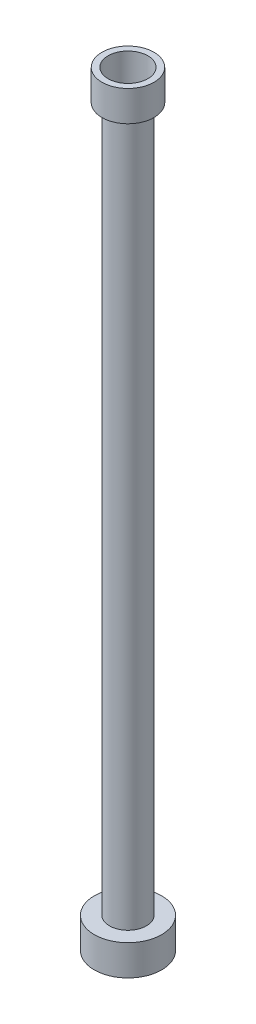
ISO-10303-21;
HEADER;
FILE_DESCRIPTION(('STEP AP214'),'2;1');
FILE_NAME('part.step','',(''),(''),'','','');
FILE_SCHEMA(('AUTOMOTIVE_DESIGN { 1 0 10303 214 1 1 1 1 }'));
ENDSEC;
DATA;
#1=APPLICATION_CONTEXT('core data for automotive mechanical design processes');
#2=APPLICATION_PROTOCOL_DEFINITION('international standard','automotive_design',2000,#1);
#3=PRODUCT_CONTEXT('',#1,'mechanical');
#4=PRODUCT('Part','Part','',(#3));
#5=PRODUCT_RELATED_PRODUCT_CATEGORY('part','',(#4));
#6=PRODUCT_DEFINITION_FORMATION('','',#4);
#7=PRODUCT_DEFINITION_CONTEXT('part definition',#1,'design');
#8=PRODUCT_DEFINITION('design','',#6,#7);
#9=PRODUCT_DEFINITION_SHAPE('','',#8);
#10=(LENGTH_UNIT() NAMED_UNIT(*) SI_UNIT(.MILLI.,.METRE.));
#11=(NAMED_UNIT(*) PLANE_ANGLE_UNIT() SI_UNIT($,.RADIAN.));
#12=(NAMED_UNIT(*) SI_UNIT($,.STERADIAN.) SOLID_ANGLE_UNIT());
#13=UNCERTAINTY_MEASURE_WITH_UNIT(LENGTH_MEASURE(1.E-05),#10,'distance_accuracy_value','');
#14=(GEOMETRIC_REPRESENTATION_CONTEXT(3) GLOBAL_UNCERTAINTY_ASSIGNED_CONTEXT((#13)) GLOBAL_UNIT_ASSIGNED_CONTEXT((#10,
#11,#12)) REPRESENTATION_CONTEXT('',''));
#15=CARTESIAN_POINT('',(0.,0.,0.));
#16=DIRECTION('',(0.,0.,1.));
#17=DIRECTION('',(1.,0.,0.));
#18=AXIS2_PLACEMENT_3D('',#15,#16,#17);
#19=CARTESIAN_POINT('',(0.,500.,0.));
#20=DIRECTION('',(0.,-1.,0.));
#21=DIRECTION('',(0.,0.,-1.));
#22=AXIS2_PLACEMENT_3D('',#19,#20,#21);
#23=CYLINDRICAL_SURFACE('',#22,8.);
#24=CARTESIAN_POINT('',(0.,0.,0.));
#25=DIRECTION('',(0.,-1.,0.));
#26=DIRECTION('',(0.,0.,-1.));
#27=AXIS2_PLACEMENT_3D('',#24,#25,#26);
#28=CIRCLE('',#27,8.);
#29=CARTESIAN_POINT('',(0.,0.,-8.));
#30=VERTEX_POINT('',#29);
#31=EDGE_CURVE('E58',#30,#30,#28,.T.);
#32=ORIENTED_EDGE('',*,*,#31,.T.);
#33=EDGE_LOOP('',(#32));
#34=FACE_BOUND('',#33,.T.);
#35=CARTESIAN_POINT('',(0.,481.,0.));
#36=DIRECTION('',(0.,1.,0.));
#37=DIRECTION('',(0.,0.,1.));
#38=AXIS2_PLACEMENT_3D('',#35,#36,#37);
#39=CIRCLE('',#38,8.);
#40=CARTESIAN_POINT('',(0.,481.,8.));
#41=VERTEX_POINT('',#40);
#42=EDGE_CURVE('E38',#41,#41,#39,.F.);
#43=ORIENTED_EDGE('',*,*,#42,.F.);
#44=EDGE_LOOP('',(#43));
#45=FACE_BOUND('',#44,.T.);
#46=ADVANCED_FACE('F34',(#34,#45),#23,.F.);
#47=CARTESIAN_POINT('',(0.,20.,0.));
#48=DIRECTION('',(0.,-1.,0.));
#49=DIRECTION('',(0.,0.,-1.));
#50=AXIS2_PLACEMENT_3D('',#47,#48,#49);
#51=CYLINDRICAL_SURFACE('',#50,22.);
#52=CARTESIAN_POINT('',(0.,20.,0.));
#53=DIRECTION('',(0.,1.,0.));
#54=DIRECTION('',(0.,0.,1.));
#55=AXIS2_PLACEMENT_3D('',#52,#53,#54);
#56=CIRCLE('',#55,22.);
#57=CARTESIAN_POINT('',(0.,20.,22.));
#58=VERTEX_POINT('',#57);
#59=EDGE_CURVE('E10',#58,#58,#56,.T.);
#60=ORIENTED_EDGE('',*,*,#59,.F.);
#61=EDGE_LOOP('',(#60));
#62=FACE_BOUND('',#61,.T.);
#63=CARTESIAN_POINT('',(0.,0.,0.));
#64=DIRECTION('',(0.,1.,0.));
#65=DIRECTION('',(0.,0.,1.));
#66=AXIS2_PLACEMENT_3D('',#63,#64,#65);
#67=CIRCLE('',#66,22.);
#68=CARTESIAN_POINT('',(0.,0.,22.));
#69=VERTEX_POINT('',#68);
#70=EDGE_CURVE('E42',#69,#69,#67,.T.);
#71=ORIENTED_EDGE('',*,*,#70,.T.);
#72=EDGE_LOOP('',(#71));
#73=FACE_BOUND('',#72,.T.);
#74=ADVANCED_FACE('F36',(#62,#73),#51,.T.);
#75=CARTESIAN_POINT('',(0.,20.,0.));
#76=DIRECTION('',(0.,1.,0.));
#77=DIRECTION('',(0.,0.,1.));
#78=AXIS2_PLACEMENT_3D('',#75,#76,#77);
#79=PLANE('',#78);
#80=CARTESIAN_POINT('',(0.,20.,0.));
#81=DIRECTION('',(0.,1.,0.));
#82=DIRECTION('',(0.,0.,1.));
#83=AXIS2_PLACEMENT_3D('',#80,#81,#82);
#84=CIRCLE('',#83,12.079771489137);
#85=CARTESIAN_POINT('',(0.,20.,12.079771489137));
#86=VERTEX_POINT('',#85);
#87=EDGE_CURVE('E49',#86,#86,#84,.T.);
#88=ORIENTED_EDGE('',*,*,#87,.F.);
#89=EDGE_LOOP('',(#88));
#90=FACE_BOUND('',#89,.T.);
#91=ORIENTED_EDGE('',*,*,#59,.T.);
#92=EDGE_LOOP('',(#91));
#93=FACE_BOUND('',#92,.T.);
#94=ADVANCED_FACE('F83',(#90,#93),#79,.T.);
#95=CARTESIAN_POINT('',(0.,0.,0.));
#96=DIRECTION('',(0.,1.,0.));
#97=DIRECTION('',(0.,0.,1.));
#98=AXIS2_PLACEMENT_3D('',#95,#96,#97);
#99=PLANE('',#98);
#100=ORIENTED_EDGE('',*,*,#31,.F.);
#101=EDGE_LOOP('',(#100));
#102=FACE_BOUND('',#101,.T.);
#103=ORIENTED_EDGE('',*,*,#70,.F.);
#104=EDGE_LOOP('',(#103));
#105=FACE_BOUND('',#104,.T.);
#106=ADVANCED_FACE('F103',(#102,#105),#99,.F.);
#107=CARTESIAN_POINT('',(0.,480.,0.));
#108=DIRECTION('',(0.,-1.,0.));
#109=DIRECTION('',(0.,0.,-1.));
#110=AXIS2_PLACEMENT_3D('',#107,#108,#109);
#111=CYLINDRICAL_SURFACE('',#110,12.079771489137);
#112=CARTESIAN_POINT('',(0.,480.,0.));
#113=DIRECTION('',(0.,1.,0.));
#114=DIRECTION('',(0.,0.,1.));
#115=AXIS2_PLACEMENT_3D('',#112,#113,#114);
#116=CIRCLE('',#115,12.079771489137);
#117=CARTESIAN_POINT('',(0.,480.,12.079771489137));
#118=VERTEX_POINT('',#117);
#119=EDGE_CURVE('E47',#118,#118,#116,.T.);
#120=ORIENTED_EDGE('',*,*,#119,.F.);
#121=EDGE_LOOP('',(#120));
#122=FACE_BOUND('',#121,.T.);
#123=ORIENTED_EDGE('',*,*,#87,.T.);
#124=EDGE_LOOP('',(#123));
#125=FACE_BOUND('',#124,.T.);
#126=ADVANCED_FACE('F99',(#122,#125),#111,.T.);
#127=CARTESIAN_POINT('',(0.,500.,0.));
#128=DIRECTION('',(0.,-1.,0.));
#129=DIRECTION('',(0.,0.,-1.));
#130=AXIS2_PLACEMENT_3D('',#127,#128,#129);
#131=CYLINDRICAL_SURFACE('',#130,17.);
#132=CARTESIAN_POINT('',(0.,500.,0.));
#133=DIRECTION('',(0.,1.,0.));
#134=DIRECTION('',(0.,0.,1.));
#135=AXIS2_PLACEMENT_3D('',#132,#133,#134);
#136=CIRCLE('',#135,17.);
#137=CARTESIAN_POINT('',(0.,500.,17.));
#138=VERTEX_POINT('',#137);
#139=EDGE_CURVE('E52',#138,#138,#136,.T.);
#140=ORIENTED_EDGE('',*,*,#139,.F.);
#141=EDGE_LOOP('',(#140));
#142=FACE_BOUND('',#141,.T.);
#143=CARTESIAN_POINT('',(0.,480.,0.));
#144=DIRECTION('',(0.,1.,0.));
#145=DIRECTION('',(0.,0.,1.));
#146=AXIS2_PLACEMENT_3D('',#143,#144,#145);
#147=CIRCLE('',#146,17.);
#148=CARTESIAN_POINT('',(0.,480.,17.));
#149=VERTEX_POINT('',#148);
#150=EDGE_CURVE('E55',#149,#149,#147,.T.);
#151=ORIENTED_EDGE('',*,*,#150,.T.);
#152=EDGE_LOOP('',(#151));
#153=FACE_BOUND('',#152,.T.);
#154=ADVANCED_FACE('F92',(#142,#153),#131,.T.);
#155=CARTESIAN_POINT('',(0.,500.,0.));
#156=DIRECTION('',(0.,1.,0.));
#157=DIRECTION('',(0.,0.,1.));
#158=AXIS2_PLACEMENT_3D('',#155,#156,#157);
#159=PLANE('',#158);
#160=CARTESIAN_POINT('',(0.,500.,0.));
#161=DIRECTION('',(0.,1.,0.));
#162=DIRECTION('',(0.,0.,1.));
#163=AXIS2_PLACEMENT_3D('',#160,#161,#162);
#164=CIRCLE('',#163,13.);
#165=CARTESIAN_POINT('',(0.,500.,13.));
#166=VERTEX_POINT('',#165);
#167=EDGE_CURVE('E63',#166,#166,#164,.T.);
#168=ORIENTED_EDGE('',*,*,#167,.F.);
#169=EDGE_LOOP('',(#168));
#170=FACE_BOUND('',#169,.T.);
#171=ORIENTED_EDGE('',*,*,#139,.T.);
#172=EDGE_LOOP('',(#171));
#173=FACE_BOUND('',#172,.T.);
#174=ADVANCED_FACE('F89',(#170,#173),#159,.T.);
#175=CARTESIAN_POINT('',(0.,480.,0.));
#176=DIRECTION('',(0.,1.,0.));
#177=DIRECTION('',(0.,0.,1.));
#178=AXIS2_PLACEMENT_3D('',#175,#176,#177);
#179=PLANE('',#178);
#180=ORIENTED_EDGE('',*,*,#119,.T.);
#181=EDGE_LOOP('',(#180));
#182=FACE_BOUND('',#181,.T.);
#183=ORIENTED_EDGE('',*,*,#150,.F.);
#184=EDGE_LOOP('',(#183));
#185=FACE_BOUND('',#184,.T.);
#186=ADVANCED_FACE('F91',(#182,#185),#179,.F.);
#187=CARTESIAN_POINT('',(0.,481.,0.));
#188=DIRECTION('',(0.,1.,0.));
#189=DIRECTION('',(0.,0.,1.));
#190=AXIS2_PLACEMENT_3D('',#187,#188,#189);
#191=PLANE('',#190);
#192=CARTESIAN_POINT('',(0.,481.,0.));
#193=DIRECTION('',(0.,1.,0.));
#194=DIRECTION('',(0.,0.,1.));
#195=AXIS2_PLACEMENT_3D('',#192,#193,#194);
#196=CIRCLE('',#195,13.);
#197=CARTESIAN_POINT('',(0.,481.,13.));
#198=VERTEX_POINT('',#197);
#199=EDGE_CURVE('E66',#198,#198,#196,.T.);
#200=ORIENTED_EDGE('',*,*,#199,.T.);
#201=EDGE_LOOP('',(#200));
#202=FACE_BOUND('',#201,.T.);
#203=ORIENTED_EDGE('',*,*,#42,.T.);
#204=EDGE_LOOP('',(#203));
#205=FACE_BOUND('',#204,.T.);
#206=ADVANCED_FACE('F73',(#202,#205),#191,.T.);
#207=CARTESIAN_POINT('',(0.,481.,0.));
#208=DIRECTION('',(0.,1.,0.));
#209=DIRECTION('',(0.,0.,1.));
#210=AXIS2_PLACEMENT_3D('',#207,#208,#209);
#211=CYLINDRICAL_SURFACE('',#210,13.);
#212=ORIENTED_EDGE('',*,*,#199,.F.);
#213=EDGE_LOOP('',(#212));
#214=FACE_BOUND('',#213,.T.);
#215=ORIENTED_EDGE('',*,*,#167,.T.);
#216=EDGE_LOOP('',(#215));
#217=FACE_BOUND('',#216,.T.);
#218=ADVANCED_FACE('F87',(#214,#217),#211,.F.);
#219=CLOSED_SHELL('',(#46,#74,#94,#106,#126,#154,#174,#186,#206,#218));
#220=MANIFOLD_SOLID_BREP('B2',#219);
#221=ADVANCED_BREP_SHAPE_REPRESENTATION('',(#18,#220),#14);
#222=SHAPE_DEFINITION_REPRESENTATION(#9,#221);
ENDSEC;
END-ISO-10303-21;
